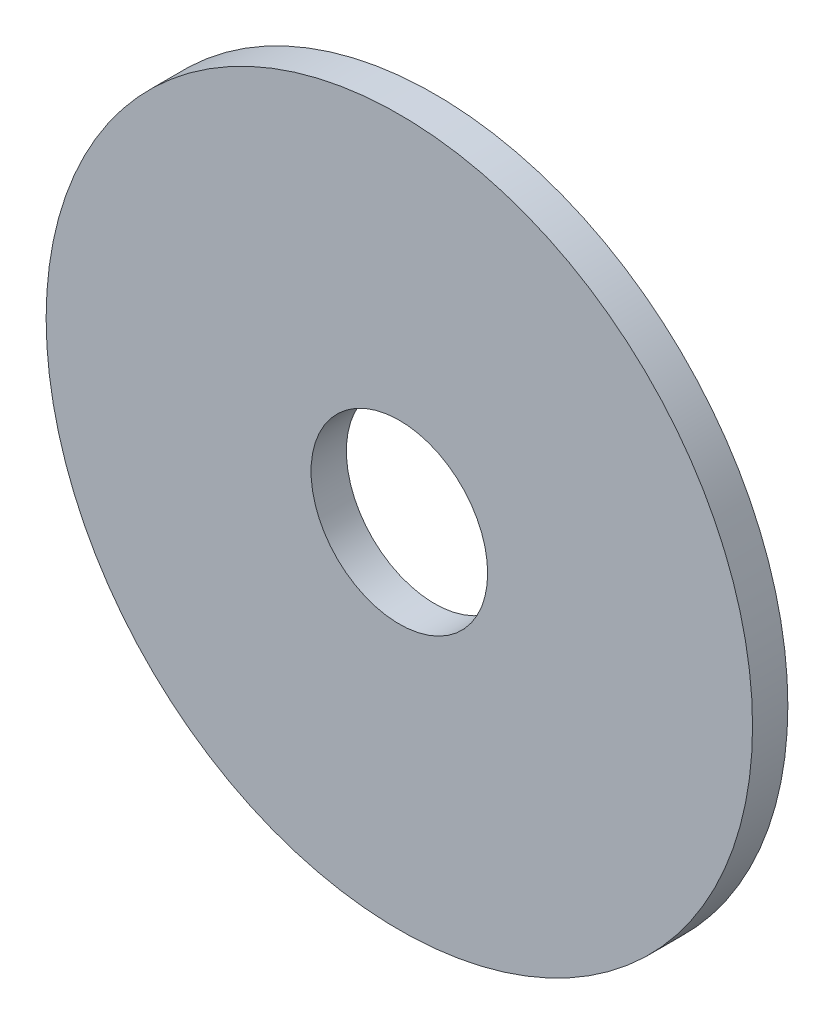
ISO-10303-21;
HEADER;
FILE_DESCRIPTION(('STEP AP214'),'2;1');
FILE_NAME('part.step','',(''),(''),'','','');
FILE_SCHEMA(('AUTOMOTIVE_DESIGN { 1 0 10303 214 1 1 1 1 }'));
ENDSEC;
DATA;
#1=APPLICATION_CONTEXT('core data for automotive mechanical design processes');
#2=APPLICATION_PROTOCOL_DEFINITION('international standard','automotive_design',2000,#1);
#3=PRODUCT_CONTEXT('',#1,'mechanical');
#4=PRODUCT('Part','Part','',(#3));
#5=PRODUCT_RELATED_PRODUCT_CATEGORY('part','',(#4));
#6=PRODUCT_DEFINITION_FORMATION('','',#4);
#7=PRODUCT_DEFINITION_CONTEXT('part definition',#1,'design');
#8=PRODUCT_DEFINITION('design','',#6,#7);
#9=PRODUCT_DEFINITION_SHAPE('','',#8);
#10=(LENGTH_UNIT() NAMED_UNIT(*) SI_UNIT(.MILLI.,.METRE.));
#11=(NAMED_UNIT(*) PLANE_ANGLE_UNIT() SI_UNIT($,.RADIAN.));
#12=(NAMED_UNIT(*) SI_UNIT($,.STERADIAN.) SOLID_ANGLE_UNIT());
#13=UNCERTAINTY_MEASURE_WITH_UNIT(LENGTH_MEASURE(1.E-05),#10,'distance_accuracy_value','');
#14=(GEOMETRIC_REPRESENTATION_CONTEXT(3) GLOBAL_UNCERTAINTY_ASSIGNED_CONTEXT((#13)) GLOBAL_UNIT_ASSIGNED_CONTEXT((#10,
#11,#12)) REPRESENTATION_CONTEXT('',''));
#15=CARTESIAN_POINT('',(0.,0.,0.));
#16=DIRECTION('',(0.,0.,1.));
#17=DIRECTION('',(1.,0.,0.));
#18=AXIS2_PLACEMENT_3D('',#15,#16,#17);
#19=CARTESIAN_POINT('',(0.,0.,2.));
#20=DIRECTION('',(0.,0.,-1.));
#21=DIRECTION('',(-1.,0.,0.));
#22=AXIS2_PLACEMENT_3D('',#19,#20,#21);
#23=CYLINDRICAL_SURFACE('',#22,20.);
#24=CARTESIAN_POINT('',(0.,0.,2.));
#25=DIRECTION('',(0.,0.,1.));
#26=DIRECTION('',(1.,0.,0.));
#27=AXIS2_PLACEMENT_3D('',#24,#25,#26);
#28=CIRCLE('',#27,20.);
#29=CARTESIAN_POINT('',(20.,0.,2.));
#30=VERTEX_POINT('',#29);
#31=EDGE_CURVE('E10',#30,#30,#28,.T.);
#32=ORIENTED_EDGE('',*,*,#31,.F.);
#33=EDGE_LOOP('',(#32));
#34=FACE_BOUND('',#33,.T.);
#35=CARTESIAN_POINT('',(0.,0.,0.));
#36=DIRECTION('',(0.,0.,1.));
#37=DIRECTION('',(1.,0.,0.));
#38=AXIS2_PLACEMENT_3D('',#35,#36,#37);
#39=CIRCLE('',#38,20.);
#40=CARTESIAN_POINT('',(20.,0.,0.));
#41=VERTEX_POINT('',#40);
#42=EDGE_CURVE('E40',#41,#41,#39,.T.);
#43=ORIENTED_EDGE('',*,*,#42,.T.);
#44=EDGE_LOOP('',(#43));
#45=FACE_BOUND('',#44,.T.);
#46=ADVANCED_FACE('F33',(#34,#45),#23,.T.);
#47=CARTESIAN_POINT('',(0.,0.,2.));
#48=DIRECTION('',(0.,0.,1.));
#49=DIRECTION('',(1.,0.,0.));
#50=AXIS2_PLACEMENT_3D('',#47,#48,#49);
#51=PLANE('',#50);
#52=CARTESIAN_POINT('',(0.,0.,2.));
#53=DIRECTION('',(0.,0.,1.));
#54=DIRECTION('',(1.,0.,0.));
#55=AXIS2_PLACEMENT_3D('',#52,#53,#54);
#56=CIRCLE('',#55,5.);
#57=CARTESIAN_POINT('',(5.,0.,2.));
#58=VERTEX_POINT('',#57);
#59=EDGE_CURVE('E46',#58,#58,#56,.T.);
#60=ORIENTED_EDGE('',*,*,#59,.F.);
#61=EDGE_LOOP('',(#60));
#62=FACE_BOUND('',#61,.T.);
#63=ORIENTED_EDGE('',*,*,#31,.T.);
#64=EDGE_LOOP('',(#63));
#65=FACE_BOUND('',#64,.T.);
#66=ADVANCED_FACE('F62',(#62,#65),#51,.T.);
#67=CARTESIAN_POINT('',(0.,0.,0.));
#68=DIRECTION('',(0.,0.,1.));
#69=DIRECTION('',(1.,0.,0.));
#70=AXIS2_PLACEMENT_3D('',#67,#68,#69);
#71=PLANE('',#70);
#72=CARTESIAN_POINT('',(0.,0.,0.));
#73=DIRECTION('',(0.,0.,1.));
#74=DIRECTION('',(1.,0.,0.));
#75=AXIS2_PLACEMENT_3D('',#72,#73,#74);
#76=CIRCLE('',#75,5.);
#77=CARTESIAN_POINT('',(5.,0.,0.));
#78=VERTEX_POINT('',#77);
#79=EDGE_CURVE('E36',#78,#78,#76,.T.);
#80=ORIENTED_EDGE('',*,*,#79,.T.);
#81=EDGE_LOOP('',(#80));
#82=FACE_BOUND('',#81,.T.);
#83=ORIENTED_EDGE('',*,*,#42,.F.);
#84=EDGE_LOOP('',(#83));
#85=FACE_BOUND('',#84,.T.);
#86=ADVANCED_FACE('F53',(#82,#85),#71,.F.);
#87=CARTESIAN_POINT('',(0.,0.,-2.));
#88=DIRECTION('',(0.,0.,1.));
#89=DIRECTION('',(1.,0.,0.));
#90=AXIS2_PLACEMENT_3D('',#87,#88,#89);
#91=CYLINDRICAL_SURFACE('',#90,5.);
#92=ORIENTED_EDGE('',*,*,#59,.T.);
#93=EDGE_LOOP('',(#92));
#94=FACE_BOUND('',#93,.T.);
#95=ORIENTED_EDGE('',*,*,#79,.F.);
#96=EDGE_LOOP('',(#95));
#97=FACE_BOUND('',#96,.T.);
#98=ADVANCED_FACE('F56',(#94,#97),#91,.F.);
#99=CLOSED_SHELL('',(#46,#66,#86,#98));
#100=MANIFOLD_SOLID_BREP('B2',#99);
#101=ADVANCED_BREP_SHAPE_REPRESENTATION('',(#18,#100),#14);
#102=SHAPE_DEFINITION_REPRESENTATION(#9,#101);
ENDSEC;
END-ISO-10303-21;
